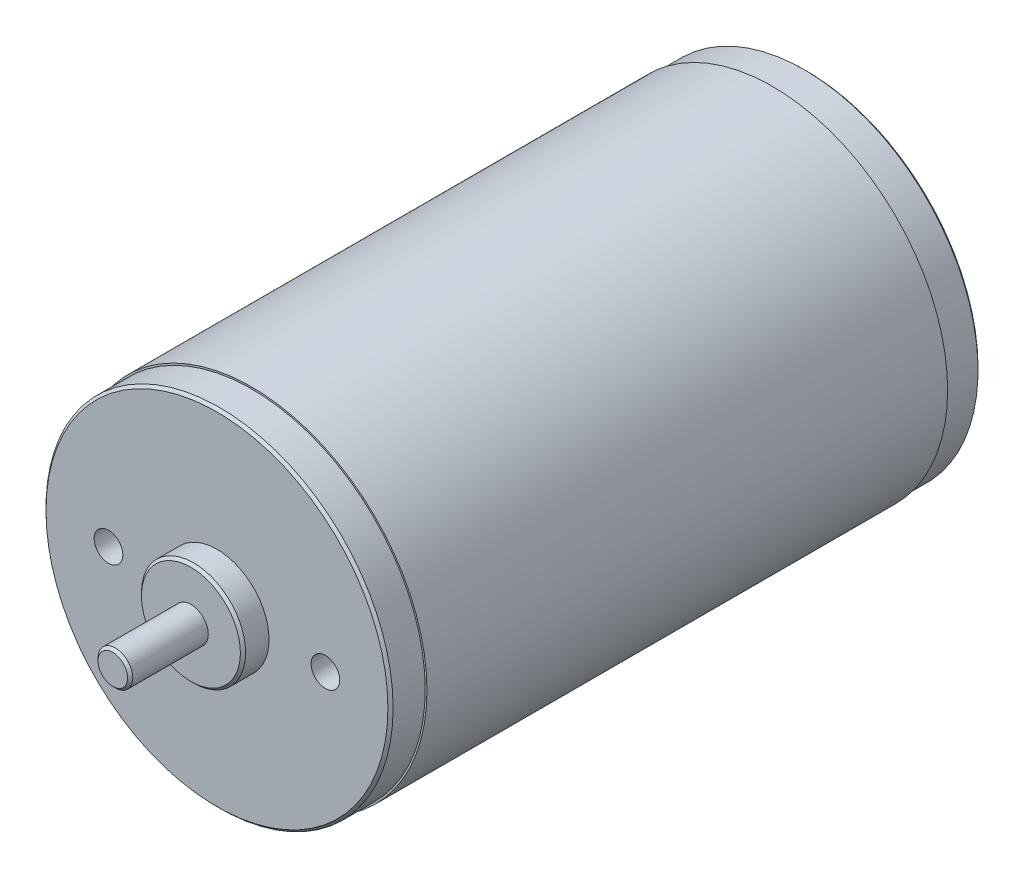
ISO-10303-21;
HEADER;
FILE_DESCRIPTION(('STEP AP214'),'2;1');
FILE_NAME('part.step','',(''),(''),'','','');
FILE_SCHEMA(('AUTOMOTIVE_DESIGN { 1 0 10303 214 1 1 1 1 }'));
ENDSEC;
DATA;
#1=APPLICATION_CONTEXT('core data for automotive mechanical design processes');
#2=APPLICATION_PROTOCOL_DEFINITION('international standard','automotive_design',2000,#1);
#3=PRODUCT_CONTEXT('',#1,'mechanical');
#4=PRODUCT('Part','Part','',(#3));
#5=PRODUCT_RELATED_PRODUCT_CATEGORY('part','',(#4));
#6=PRODUCT_DEFINITION_FORMATION('','',#4);
#7=PRODUCT_DEFINITION_CONTEXT('part definition',#1,'design');
#8=PRODUCT_DEFINITION('design','',#6,#7);
#9=PRODUCT_DEFINITION_SHAPE('','',#8);
#10=(LENGTH_UNIT() NAMED_UNIT(*) SI_UNIT(.MILLI.,.METRE.));
#11=(NAMED_UNIT(*) PLANE_ANGLE_UNIT() SI_UNIT($,.RADIAN.));
#12=(NAMED_UNIT(*) SI_UNIT($,.STERADIAN.) SOLID_ANGLE_UNIT());
#13=UNCERTAINTY_MEASURE_WITH_UNIT(LENGTH_MEASURE(1.E-05),#10,'distance_accuracy_value','');
#14=(GEOMETRIC_REPRESENTATION_CONTEXT(3) GLOBAL_UNCERTAINTY_ASSIGNED_CONTEXT((#13)) GLOBAL_UNIT_ASSIGNED_CONTEXT((#10,
#11,#12)) REPRESENTATION_CONTEXT('',''));
#15=CARTESIAN_POINT('',(0.,0.,0.));
#16=DIRECTION('',(0.,0.,1.));
#17=DIRECTION('',(1.,0.,0.));
#18=AXIS2_PLACEMENT_3D('',#15,#16,#17);
#19=CARTESIAN_POINT('',(0.,0.,-68.));
#20=DIRECTION('',(0.,0.,-1.));
#21=DIRECTION('',(-1.,0.,0.));
#22=AXIS2_PLACEMENT_3D('',#19,#20,#21);
#23=PLANE('',#22);
#24=CARTESIAN_POINT('',(0.,0.,-68.));
#25=DIRECTION('',(0.,0.,-1.));
#26=DIRECTION('',(-1.,0.,0.));
#27=AXIS2_PLACEMENT_3D('',#24,#25,#26);
#28=CIRCLE('',#27,19.7000000000306);
#29=CARTESIAN_POINT('',(-19.7000000000306,0.,-68.));
#30=VERTEX_POINT('',#29);
#31=EDGE_CURVE('E92',#30,#30,#28,.T.);
#32=ORIENTED_EDGE('',*,*,#31,.T.);
#33=EDGE_LOOP('',(#32));
#34=FACE_BOUND('',#33,.T.);
#35=CARTESIAN_POINT('',(0.,0.,-68.));
#36=DIRECTION('',(0.,0.,-1.));
#37=DIRECTION('',(-1.,0.,0.));
#38=AXIS2_PLACEMENT_3D('',#35,#36,#37);
#39=CIRCLE('',#38,6.325);
#40=CARTESIAN_POINT('',(-6.325,0.,-68.));
#41=VERTEX_POINT('',#40);
#42=EDGE_CURVE('E71',#41,#41,#39,.T.);
#43=ORIENTED_EDGE('',*,*,#42,.F.);
#44=EDGE_LOOP('',(#43));
#45=FACE_BOUND('',#44,.T.);
#46=ADVANCED_FACE('F36',(#34,#45),#23,.T.);
#47=CARTESIAN_POINT('',(20.2,0.,-64.));
#48=DIRECTION('',(0.,0.,-1.));
#49=DIRECTION('',(-1.,0.,0.));
#50=AXIS2_PLACEMENT_3D('',#47,#48,#49);
#51=PLANE('',#50);
#52=CARTESIAN_POINT('',(0.,0.,-64.));
#53=DIRECTION('',(0.,0.,1.));
#54=DIRECTION('',(1.,0.,0.));
#55=AXIS2_PLACEMENT_3D('',#52,#53,#54);
#56=CIRCLE('',#55,20.2);
#57=CARTESIAN_POINT('',(20.2,0.,-64.));
#58=VERTEX_POINT('',#57);
#59=EDGE_CURVE('E89',#58,#58,#56,.T.);
#60=ORIENTED_EDGE('',*,*,#59,.F.);
#61=EDGE_LOOP('',(#60));
#62=FACE_BOUND('',#61,.T.);
#63=CARTESIAN_POINT('',(0.,0.,-64.));
#64=DIRECTION('',(0.,0.,-1.));
#65=DIRECTION('',(-1.,0.,0.));
#66=AXIS2_PLACEMENT_3D('',#63,#64,#65);
#67=CIRCLE('',#66,20.);
#68=CARTESIAN_POINT('',(-20.,0.,-64.));
#69=VERTEX_POINT('',#68);
#70=EDGE_CURVE('E74',#69,#69,#67,.T.);
#71=ORIENTED_EDGE('',*,*,#70,.F.);
#72=EDGE_LOOP('',(#71));
#73=FACE_BOUND('',#72,.T.);
#74=ADVANCED_FACE('F131',(#62,#73),#51,.T.);
#75=CARTESIAN_POINT('',(0.,0.,3.));
#76=DIRECTION('',(0.,0.,1.));
#77=DIRECTION('',(1.,0.,0.));
#78=AXIS2_PLACEMENT_3D('',#75,#76,#77);
#79=PLANE('',#78);
#80=CARTESIAN_POINT('',(0.,0.,3.));
#81=DIRECTION('',(0.,0.,1.));
#82=DIRECTION('',(1.,0.,0.));
#83=AXIS2_PLACEMENT_3D('',#80,#81,#82);
#84=CIRCLE('',#83,5.70000000003062);
#85=CARTESIAN_POINT('',(5.70000000003062,0.,3.));
#86=VERTEX_POINT('',#85);
#87=EDGE_CURVE('E44',#86,#86,#84,.T.);
#88=ORIENTED_EDGE('',*,*,#87,.T.);
#89=EDGE_LOOP('',(#88));
#90=FACE_BOUND('',#89,.T.);
#91=CARTESIAN_POINT('',(0.,0.,3.));
#92=DIRECTION('',(0.,0.,1.));
#93=DIRECTION('',(1.,0.,0.));
#94=AXIS2_PLACEMENT_3D('',#91,#92,#93);
#95=CIRCLE('',#94,2.);
#96=CARTESIAN_POINT('',(2.,0.,3.));
#97=VERTEX_POINT('',#96);
#98=EDGE_CURVE('E77',#97,#97,#95,.T.);
#99=ORIENTED_EDGE('',*,*,#98,.F.);
#100=EDGE_LOOP('',(#99));
#101=FACE_BOUND('',#100,.T.);
#102=ADVANCED_FACE('F118',(#90,#101),#79,.T.);
#103=CARTESIAN_POINT('',(0.,0.,0.));
#104=DIRECTION('',(0.,0.,1.));
#105=DIRECTION('',(1.,0.,0.));
#106=AXIS2_PLACEMENT_3D('',#103,#104,#105);
#107=PLANE('',#106);
#108=CARTESIAN_POINT('',(0.,0.,0.));
#109=DIRECTION('',(0.,0.,1.));
#110=DIRECTION('',(1.,0.,0.));
#111=AXIS2_PLACEMENT_3D('',#108,#109,#110);
#112=CIRCLE('',#111,19.7000000000306);
#113=CARTESIAN_POINT('',(19.7000000000306,0.,0.));
#114=VERTEX_POINT('',#113);
#115=EDGE_CURVE('E104',#114,#114,#112,.T.);
#116=ORIENTED_EDGE('',*,*,#115,.T.);
#117=EDGE_LOOP('',(#116));
#118=FACE_BOUND('',#117,.T.);
#119=CARTESIAN_POINT('',(-12.5,0.,0.));
#120=DIRECTION('',(0.,0.,1.));
#121=DIRECTION('',(1.,0.,0.));
#122=AXIS2_PLACEMENT_3D('',#119,#120,#121);
#123=CIRCLE('',#122,1.64999999999999);
#124=CARTESIAN_POINT('',(-10.85,0.,0.));
#125=VERTEX_POINT('',#124);
#126=EDGE_CURVE('E61',#125,#125,#123,.T.);
#127=ORIENTED_EDGE('',*,*,#126,.F.);
#128=EDGE_LOOP('',(#127));
#129=FACE_BOUND('',#128,.T.);
#130=CARTESIAN_POINT('',(12.5,0.,0.));
#131=DIRECTION('',(0.,0.,1.));
#132=DIRECTION('',(1.,0.,0.));
#133=AXIS2_PLACEMENT_3D('',#130,#131,#132);
#134=CIRCLE('',#133,1.64999999999999);
#135=CARTESIAN_POINT('',(14.15,0.,0.));
#136=VERTEX_POINT('',#135);
#137=EDGE_CURVE('E60',#136,#136,#134,.T.);
#138=ORIENTED_EDGE('',*,*,#137,.F.);
#139=EDGE_LOOP('',(#138));
#140=FACE_BOUND('',#139,.T.);
#141=CARTESIAN_POINT('',(0.,0.,0.));
#142=DIRECTION('',(0.,0.,1.));
#143=DIRECTION('',(1.,0.,0.));
#144=AXIS2_PLACEMENT_3D('',#141,#142,#143);
#145=CIRCLE('',#144,6.);
#146=CARTESIAN_POINT('',(6.,0.,0.));
#147=VERTEX_POINT('',#146);
#148=EDGE_CURVE('E80',#147,#147,#145,.T.);
#149=ORIENTED_EDGE('',*,*,#148,.F.);
#150=EDGE_LOOP('',(#149));
#151=FACE_BOUND('',#150,.T.);
#152=ADVANCED_FACE('F159',(#118,#129,#140,#151),#107,.T.);
#153=CARTESIAN_POINT('',(0.,0.,-4.));
#154=DIRECTION('',(0.,0.,1.));
#155=DIRECTION('',(1.,0.,0.));
#156=AXIS2_PLACEMENT_3D('',#153,#154,#155);
#157=PLANE('',#156);
#158=CARTESIAN_POINT('',(0.,0.,-4.));
#159=DIRECTION('',(0.,0.,1.));
#160=DIRECTION('',(1.,0.,0.));
#161=AXIS2_PLACEMENT_3D('',#158,#159,#160);
#162=CIRCLE('',#161,20.2);
#163=CARTESIAN_POINT('',(20.2,0.,-4.));
#164=VERTEX_POINT('',#163);
#165=EDGE_CURVE('E86',#164,#164,#162,.T.);
#166=ORIENTED_EDGE('',*,*,#165,.T.);
#167=EDGE_LOOP('',(#166));
#168=FACE_BOUND('',#167,.T.);
#169=CARTESIAN_POINT('',(0.,0.,-4.));
#170=DIRECTION('',(0.,0.,1.));
#171=DIRECTION('',(1.,0.,0.));
#172=AXIS2_PLACEMENT_3D('',#169,#170,#171);
#173=CIRCLE('',#172,20.);
#174=CARTESIAN_POINT('',(20.,0.,-4.));
#175=VERTEX_POINT('',#174);
#176=EDGE_CURVE('E83',#175,#175,#173,.T.);
#177=ORIENTED_EDGE('',*,*,#176,.F.);
#178=EDGE_LOOP('',(#177));
#179=FACE_BOUND('',#178,.T.);
#180=ADVANCED_FACE('F166',(#168,#179),#157,.T.);
#181=CARTESIAN_POINT('',(0.,0.,-64.));
#182=DIRECTION('',(0.,0.,1.));
#183=DIRECTION('',(1.,0.,0.));
#184=AXIS2_PLACEMENT_3D('',#181,#182,#183);
#185=CYLINDRICAL_SURFACE('',#184,20.2);
#186=ORIENTED_EDGE('',*,*,#59,.T.);
#187=EDGE_LOOP('',(#186));
#188=FACE_BOUND('',#187,.T.);
#189=ORIENTED_EDGE('',*,*,#165,.F.);
#190=EDGE_LOOP('',(#189));
#191=FACE_BOUND('',#190,.T.);
#192=ADVANCED_FACE('F170',(#188,#191),#185,.T.);
#193=CARTESIAN_POINT('',(0.,0.,0.));
#194=DIRECTION('',(0.,0.,-1.));
#195=DIRECTION('',(-1.,0.,0.));
#196=AXIS2_PLACEMENT_3D('',#193,#194,#195);
#197=CYLINDRICAL_SURFACE('',#196,20.);
#198=CARTESIAN_POINT('',(0.,0.,-0.299999999969389));
#199=DIRECTION('',(0.,0.,1.));
#200=DIRECTION('',(1.,0.,0.));
#201=AXIS2_PLACEMENT_3D('',#198,#199,#200);
#202=CIRCLE('',#201,20.);
#203=CARTESIAN_POINT('',(20.,0.,-0.299999999969389));
#204=VERTEX_POINT('',#203);
#205=EDGE_CURVE('E107',#204,#204,#202,.F.);
#206=ORIENTED_EDGE('',*,*,#205,.T.);
#207=EDGE_LOOP('',(#206));
#208=FACE_BOUND('',#207,.T.);
#209=ORIENTED_EDGE('',*,*,#176,.T.);
#210=EDGE_LOOP('',(#209));
#211=FACE_BOUND('',#210,.T.);
#212=ADVANCED_FACE('F162',(#208,#211),#197,.T.);
#213=CARTESIAN_POINT('',(0.,0.,3.));
#214=DIRECTION('',(0.,0.,-1.));
#215=DIRECTION('',(-1.,0.,0.));
#216=AXIS2_PLACEMENT_3D('',#213,#214,#215);
#217=CYLINDRICAL_SURFACE('',#216,6.);
#218=CARTESIAN_POINT('',(0.,0.,2.70000000003062));
#219=DIRECTION('',(0.,0.,1.));
#220=DIRECTION('',(1.,0.,0.));
#221=AXIS2_PLACEMENT_3D('',#218,#219,#220);
#222=CIRCLE('',#221,6.);
#223=CARTESIAN_POINT('',(6.,0.,2.70000000003062));
#224=VERTEX_POINT('',#223);
#225=EDGE_CURVE('E11',#224,#224,#222,.F.);
#226=ORIENTED_EDGE('',*,*,#225,.T.);
#227=EDGE_LOOP('',(#226));
#228=FACE_BOUND('',#227,.T.);
#229=ORIENTED_EDGE('',*,*,#148,.T.);
#230=EDGE_LOOP('',(#229));
#231=FACE_BOUND('',#230,.T.);
#232=ADVANCED_FACE('F155',(#228,#231),#217,.T.);
#233=CARTESIAN_POINT('',(0.,0.,12.));
#234=DIRECTION('',(0.,0.,-1.));
#235=DIRECTION('',(-1.,0.,0.));
#236=AXIS2_PLACEMENT_3D('',#233,#234,#235);
#237=CYLINDRICAL_SURFACE('',#236,2.);
#238=CARTESIAN_POINT('',(0.,0.,11.7000000000306));
#239=DIRECTION('',(0.,0.,1.));
#240=DIRECTION('',(1.,0.,0.));
#241=AXIS2_PLACEMENT_3D('',#238,#239,#240);
#242=CIRCLE('',#241,2.);
#243=CARTESIAN_POINT('',(2.,0.,11.7000000000306));
#244=VERTEX_POINT('',#243);
#245=EDGE_CURVE('E101',#244,#244,#242,.F.);
#246=ORIENTED_EDGE('',*,*,#245,.T.);
#247=EDGE_LOOP('',(#246));
#248=FACE_BOUND('',#247,.T.);
#249=ORIENTED_EDGE('',*,*,#98,.T.);
#250=EDGE_LOOP('',(#249));
#251=FACE_BOUND('',#250,.T.);
#252=ADVANCED_FACE('F151',(#248,#251),#237,.T.);
#253=CARTESIAN_POINT('',(0.,0.,12.));
#254=DIRECTION('',(0.,0.,1.));
#255=DIRECTION('',(1.,0.,0.));
#256=AXIS2_PLACEMENT_3D('',#253,#254,#255);
#257=PLANE('',#256);
#258=CARTESIAN_POINT('',(0.,0.,12.));
#259=DIRECTION('',(0.,0.,1.));
#260=DIRECTION('',(1.,0.,0.));
#261=AXIS2_PLACEMENT_3D('',#258,#259,#260);
#262=CIRCLE('',#261,1.70000000003065);
#263=CARTESIAN_POINT('',(1.70000000003065,0.,12.));
#264=VERTEX_POINT('',#263);
#265=EDGE_CURVE('E98',#264,#264,#262,.T.);
#266=ORIENTED_EDGE('',*,*,#265,.T.);
#267=EDGE_LOOP('',(#266));
#268=FACE_BOUND('',#267,.T.);
#269=ADVANCED_FACE('F147',(#268),#257,.T.);
#270=CARTESIAN_POINT('',(0.,0.,-68.));
#271=DIRECTION('',(0.,0.,1.));
#272=DIRECTION('',(1.,0.,0.));
#273=AXIS2_PLACEMENT_3D('',#270,#271,#272);
#274=CYLINDRICAL_SURFACE('',#273,20.);
#275=CARTESIAN_POINT('',(0.,0.,-67.7000000000306));
#276=DIRECTION('',(0.,0.,-1.));
#277=DIRECTION('',(-1.,0.,0.));
#278=AXIS2_PLACEMENT_3D('',#275,#276,#277);
#279=CIRCLE('',#278,20.);
#280=CARTESIAN_POINT('',(-20.,0.,-67.7000000000306));
#281=VERTEX_POINT('',#280);
#282=EDGE_CURVE('E95',#281,#281,#279,.F.);
#283=ORIENTED_EDGE('',*,*,#282,.T.);
#284=EDGE_LOOP('',(#283));
#285=FACE_BOUND('',#284,.T.);
#286=ORIENTED_EDGE('',*,*,#70,.T.);
#287=EDGE_LOOP('',(#286));
#288=FACE_BOUND('',#287,.T.);
#289=ADVANCED_FACE('F144',(#285,#288),#274,.T.);
#290=CARTESIAN_POINT('',(0.,0.,-69.5));
#291=DIRECTION('',(0.,0.,1.));
#292=DIRECTION('',(1.,0.,0.));
#293=AXIS2_PLACEMENT_3D('',#290,#291,#292);
#294=CYLINDRICAL_SURFACE('',#293,6.325);
#295=CARTESIAN_POINT('',(0.,0.,-69.2000000000306));
#296=DIRECTION('',(0.,0.,-1.));
#297=DIRECTION('',(-1.,0.,0.));
#298=AXIS2_PLACEMENT_3D('',#295,#296,#297);
#299=CIRCLE('',#298,6.325);
#300=CARTESIAN_POINT('',(-6.325,0.,-69.2000000000306));
#301=VERTEX_POINT('',#300);
#302=EDGE_CURVE('E113',#301,#301,#299,.F.);
#303=ORIENTED_EDGE('',*,*,#302,.T.);
#304=EDGE_LOOP('',(#303));
#305=FACE_BOUND('',#304,.T.);
#306=ORIENTED_EDGE('',*,*,#42,.T.);
#307=EDGE_LOOP('',(#306));
#308=FACE_BOUND('',#307,.T.);
#309=ADVANCED_FACE('F142',(#305,#308),#294,.T.);
#310=CARTESIAN_POINT('',(0.,0.,-69.5));
#311=DIRECTION('',(0.,0.,-1.));
#312=DIRECTION('',(-1.,0.,0.));
#313=AXIS2_PLACEMENT_3D('',#310,#311,#312);
#314=PLANE('',#313);
#315=CARTESIAN_POINT('',(0.,0.,-69.5));
#316=DIRECTION('',(0.,0.,-1.));
#317=DIRECTION('',(-1.,0.,0.));
#318=AXIS2_PLACEMENT_3D('',#315,#316,#317);
#319=CIRCLE('',#318,6.02500000003062);
#320=CARTESIAN_POINT('',(-6.02500000003062,0.,-69.5));
#321=VERTEX_POINT('',#320);
#322=EDGE_CURVE('E110',#321,#321,#319,.T.);
#323=ORIENTED_EDGE('',*,*,#322,.T.);
#324=EDGE_LOOP('',(#323));
#325=FACE_BOUND('',#324,.T.);
#326=ADVANCED_FACE('F208',(#325),#314,.T.);
#327=CARTESIAN_POINT('',(12.5,0.,-8.1));
#328=DIRECTION('',(0.,0.,1.));
#329=DIRECTION('',(1.,0.,0.));
#330=AXIS2_PLACEMENT_3D('',#327,#328,#329);
#331=CONICAL_SURFACE('',#330,1.64999999999999,1.02974425849464);
#332=CARTESIAN_POINT('',(12.5,0.,-9.09142002180421));
#333=VERTEX_POINT('',#332);
#334=VERTEX_LOOP('',#333);
#335=FACE_BOUND('',#334,.T.);
#336=CARTESIAN_POINT('',(12.5,0.,-8.1));
#337=DIRECTION('',(0.,0.,1.));
#338=DIRECTION('',(1.,0.,0.));
#339=AXIS2_PLACEMENT_3D('',#336,#337,#338);
#340=CIRCLE('',#339,1.64999999999999);
#341=CARTESIAN_POINT('',(14.15,0.,-8.1));
#342=VERTEX_POINT('',#341);
#343=EDGE_CURVE('E64',#342,#342,#340,.T.);
#344=ORIENTED_EDGE('',*,*,#343,.T.);
#345=EDGE_LOOP('',(#344));
#346=FACE_BOUND('',#345,.T.);
#347=ADVANCED_FACE('F202',(#335,#346),#331,.F.);
#348=CARTESIAN_POINT('',(12.5,0.,0.));
#349=DIRECTION('',(0.,0.,1.));
#350=DIRECTION('',(1.,0.,0.));
#351=AXIS2_PLACEMENT_3D('',#348,#349,#350);
#352=CYLINDRICAL_SURFACE('',#351,1.64999999999999);
#353=ORIENTED_EDGE('',*,*,#343,.F.);
#354=EDGE_LOOP('',(#353));
#355=FACE_BOUND('',#354,.T.);
#356=ORIENTED_EDGE('',*,*,#137,.T.);
#357=EDGE_LOOP('',(#356));
#358=FACE_BOUND('',#357,.T.);
#359=ADVANCED_FACE('F54',(#355,#358),#352,.F.);
#360=CARTESIAN_POINT('',(-12.5,0.,-8.1));
#361=DIRECTION('',(0.,0.,1.));
#362=DIRECTION('',(1.,0.,0.));
#363=AXIS2_PLACEMENT_3D('',#360,#361,#362);
#364=CONICAL_SURFACE('',#363,1.64999999999999,1.02974425849464);
#365=CARTESIAN_POINT('',(-12.5,0.,-9.09142002180421));
#366=VERTEX_POINT('',#365);
#367=VERTEX_LOOP('',#366);
#368=FACE_BOUND('',#367,.T.);
#369=CARTESIAN_POINT('',(-12.5,0.,-8.1));
#370=DIRECTION('',(0.,0.,1.));
#371=DIRECTION('',(1.,0.,0.));
#372=AXIS2_PLACEMENT_3D('',#369,#370,#371);
#373=CIRCLE('',#372,1.64999999999999);
#374=CARTESIAN_POINT('',(-10.85,0.,-8.1));
#375=VERTEX_POINT('',#374);
#376=EDGE_CURVE('E58',#375,#375,#373,.T.);
#377=ORIENTED_EDGE('',*,*,#376,.T.);
#378=EDGE_LOOP('',(#377));
#379=FACE_BOUND('',#378,.T.);
#380=ADVANCED_FACE('F50',(#368,#379),#364,.F.);
#381=CARTESIAN_POINT('',(-12.5,0.,0.));
#382=DIRECTION('',(0.,0.,1.));
#383=DIRECTION('',(1.,0.,0.));
#384=AXIS2_PLACEMENT_3D('',#381,#382,#383);
#385=CYLINDRICAL_SURFACE('',#384,1.64999999999999);
#386=ORIENTED_EDGE('',*,*,#376,.F.);
#387=EDGE_LOOP('',(#386));
#388=FACE_BOUND('',#387,.T.);
#389=ORIENTED_EDGE('',*,*,#126,.T.);
#390=EDGE_LOOP('',(#389));
#391=FACE_BOUND('',#390,.T.);
#392=ADVANCED_FACE('F53',(#388,#391),#385,.F.);
#393=CARTESIAN_POINT('',(0.,0.,-68.));
#394=DIRECTION('',(0.,0.,1.));
#395=DIRECTION('',(1.,0.,0.));
#396=AXIS2_PLACEMENT_3D('',#393,#394,#395);
#397=CONICAL_SURFACE('',#396,19.7000000000306,0.785398163397466);
#398=ORIENTED_EDGE('',*,*,#282,.F.);
#399=EDGE_LOOP('',(#398));
#400=FACE_BOUND('',#399,.T.);
#401=ORIENTED_EDGE('',*,*,#31,.F.);
#402=EDGE_LOOP('',(#401));
#403=FACE_BOUND('',#402,.T.);
#404=ADVANCED_FACE('F178',(#400,#403),#397,.T.);
#405=CARTESIAN_POINT('',(0.,0.,12.));
#406=DIRECTION('',(0.,0.,-1.));
#407=DIRECTION('',(-1.,0.,0.));
#408=AXIS2_PLACEMENT_3D('',#405,#406,#407);
#409=CONICAL_SURFACE('',#408,1.70000000003065,0.785398163397431);
#410=ORIENTED_EDGE('',*,*,#245,.F.);
#411=EDGE_LOOP('',(#410));
#412=FACE_BOUND('',#411,.T.);
#413=ORIENTED_EDGE('',*,*,#265,.F.);
#414=EDGE_LOOP('',(#413));
#415=FACE_BOUND('',#414,.T.);
#416=ADVANCED_FACE('F181',(#412,#415),#409,.T.);
#417=CARTESIAN_POINT('',(0.,0.,0.));
#418=DIRECTION('',(0.,0.,-1.));
#419=DIRECTION('',(-1.,0.,0.));
#420=AXIS2_PLACEMENT_3D('',#417,#418,#419);
#421=CONICAL_SURFACE('',#420,19.7000000000306,0.785398163397454);
#422=ORIENTED_EDGE('',*,*,#205,.F.);
#423=EDGE_LOOP('',(#422));
#424=FACE_BOUND('',#423,.T.);
#425=ORIENTED_EDGE('',*,*,#115,.F.);
#426=EDGE_LOOP('',(#425));
#427=FACE_BOUND('',#426,.T.);
#428=ADVANCED_FACE('F127',(#424,#427),#421,.T.);
#429=CARTESIAN_POINT('',(0.,0.,-69.5));
#430=DIRECTION('',(0.,0.,1.));
#431=DIRECTION('',(1.,0.,0.));
#432=AXIS2_PLACEMENT_3D('',#429,#430,#431);
#433=CONICAL_SURFACE('',#432,6.02500000003062,0.785398163397431);
#434=ORIENTED_EDGE('',*,*,#302,.F.);
#435=EDGE_LOOP('',(#434));
#436=FACE_BOUND('',#435,.T.);
#437=ORIENTED_EDGE('',*,*,#322,.F.);
#438=EDGE_LOOP('',(#437));
#439=FACE_BOUND('',#438,.T.);
#440=ADVANCED_FACE('F122',(#436,#439),#433,.T.);
#441=CARTESIAN_POINT('',(0.,0.,3.));
#442=DIRECTION('',(0.,0.,-1.));
#443=DIRECTION('',(-1.,0.,0.));
#444=AXIS2_PLACEMENT_3D('',#441,#442,#443);
#445=CONICAL_SURFACE('',#444,5.70000000003062,0.785398163397438);
#446=ORIENTED_EDGE('',*,*,#225,.F.);
#447=EDGE_LOOP('',(#446));
#448=FACE_BOUND('',#447,.T.);
#449=ORIENTED_EDGE('',*,*,#87,.F.);
#450=EDGE_LOOP('',(#449));
#451=FACE_BOUND('',#450,.T.);
#452=ADVANCED_FACE('F38',(#448,#451),#445,.T.);
#453=CLOSED_SHELL('',(#46,#74,#102,#152,#180,#192,#212,#232,#252,#269,#289,#309,#326,#347,#359,
#380,#392,#404,#416,#428,#440,#452));
#454=MANIFOLD_SOLID_BREP('B2',#453);
#455=ADVANCED_BREP_SHAPE_REPRESENTATION('',(#18,#454),#14);
#456=SHAPE_DEFINITION_REPRESENTATION(#9,#455);
ENDSEC;
END-ISO-10303-21;
